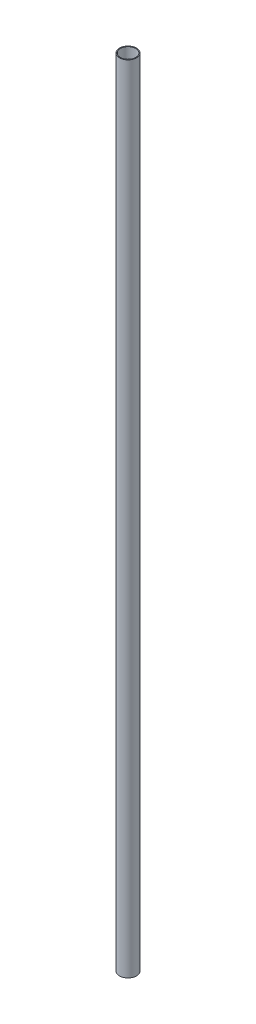
ISO-10303-21;
HEADER;
FILE_DESCRIPTION(('STEP AP214'),'2;1');
FILE_NAME('part.step','',(''),(''),'','','');
FILE_SCHEMA(('AUTOMOTIVE_DESIGN { 1 0 10303 214 1 1 1 1 }'));
ENDSEC;
DATA;
#1=APPLICATION_CONTEXT('core data for automotive mechanical design processes');
#2=APPLICATION_PROTOCOL_DEFINITION('international standard','automotive_design',2000,#1);
#3=PRODUCT_CONTEXT('',#1,'mechanical');
#4=PRODUCT('Part','Part','',(#3));
#5=PRODUCT_RELATED_PRODUCT_CATEGORY('part','',(#4));
#6=PRODUCT_DEFINITION_FORMATION('','',#4);
#7=PRODUCT_DEFINITION_CONTEXT('part definition',#1,'design');
#8=PRODUCT_DEFINITION('design','',#6,#7);
#9=PRODUCT_DEFINITION_SHAPE('','',#8);
#10=(LENGTH_UNIT() NAMED_UNIT(*) SI_UNIT(.MILLI.,.METRE.));
#11=(NAMED_UNIT(*) PLANE_ANGLE_UNIT() SI_UNIT($,.RADIAN.));
#12=(NAMED_UNIT(*) SI_UNIT($,.STERADIAN.) SOLID_ANGLE_UNIT());
#13=UNCERTAINTY_MEASURE_WITH_UNIT(LENGTH_MEASURE(1.E-05),#10,'distance_accuracy_value','');
#14=(GEOMETRIC_REPRESENTATION_CONTEXT(3) GLOBAL_UNCERTAINTY_ASSIGNED_CONTEXT((#13)) GLOBAL_UNIT_ASSIGNED_CONTEXT((#10,
#11,#12)) REPRESENTATION_CONTEXT('',''));
#15=CARTESIAN_POINT('',(0.,0.,0.));
#16=DIRECTION('',(0.,0.,1.));
#17=DIRECTION('',(1.,0.,0.));
#18=AXIS2_PLACEMENT_3D('',#15,#16,#17);
#19=CARTESIAN_POINT('',(0.,889.,0.));
#20=DIRECTION('',(0.,1.,0.));
#21=DIRECTION('',(0.,0.,1.));
#22=AXIS2_PLACEMENT_3D('',#19,#20,#21);
#23=PLANE('',#22);
#24=CARTESIAN_POINT('',(0.,889.,0.));
#25=DIRECTION('',(0.,1.,0.));
#26=DIRECTION('',(0.,0.,1.));
#27=AXIS2_PLACEMENT_3D('',#24,#25,#26);
#28=CIRCLE('',#27,9.525);
#29=CARTESIAN_POINT('',(0.,889.,9.525));
#30=VERTEX_POINT('',#29);
#31=EDGE_CURVE('E10',#30,#30,#28,.T.);
#32=ORIENTED_EDGE('',*,*,#31,.T.);
#33=EDGE_LOOP('',(#32));
#34=FACE_BOUND('',#33,.T.);
#35=CARTESIAN_POINT('',(0.,889.,0.));
#36=DIRECTION('',(0.,1.,0.));
#37=DIRECTION('',(0.,0.,1.));
#38=AXIS2_PLACEMENT_3D('',#35,#36,#37);
#39=CIRCLE('',#38,8.636);
#40=CARTESIAN_POINT('',(0.,889.,8.636));
#41=VERTEX_POINT('',#40);
#42=EDGE_CURVE('E43',#41,#41,#39,.T.);
#43=ORIENTED_EDGE('',*,*,#42,.F.);
#44=EDGE_LOOP('',(#43));
#45=FACE_BOUND('',#44,.T.);
#46=ADVANCED_FACE('F32',(#34,#45),#23,.T.);
#47=CARTESIAN_POINT('',(0.,0.,0.));
#48=DIRECTION('',(0.,1.,0.));
#49=DIRECTION('',(0.,0.,1.));
#50=AXIS2_PLACEMENT_3D('',#47,#48,#49);
#51=PLANE('',#50);
#52=CARTESIAN_POINT('',(0.,0.,0.));
#53=DIRECTION('',(0.,1.,0.));
#54=DIRECTION('',(0.,0.,1.));
#55=AXIS2_PLACEMENT_3D('',#52,#53,#54);
#56=CIRCLE('',#55,9.525);
#57=CARTESIAN_POINT('',(0.,0.,9.525));
#58=VERTEX_POINT('',#57);
#59=EDGE_CURVE('E36',#58,#58,#56,.T.);
#60=ORIENTED_EDGE('',*,*,#59,.F.);
#61=EDGE_LOOP('',(#60));
#62=FACE_BOUND('',#61,.T.);
#63=CARTESIAN_POINT('',(0.,0.,0.));
#64=DIRECTION('',(0.,1.,0.));
#65=DIRECTION('',(0.,0.,1.));
#66=AXIS2_PLACEMENT_3D('',#63,#64,#65);
#67=CIRCLE('',#66,8.636);
#68=CARTESIAN_POINT('',(0.,0.,8.636));
#69=VERTEX_POINT('',#68);
#70=EDGE_CURVE('E45',#69,#69,#67,.T.);
#71=ORIENTED_EDGE('',*,*,#70,.T.);
#72=EDGE_LOOP('',(#71));
#73=FACE_BOUND('',#72,.T.);
#74=ADVANCED_FACE('F55',(#62,#73),#51,.F.);
#75=CARTESIAN_POINT('',(0.,889.,0.));
#76=DIRECTION('',(0.,-1.,0.));
#77=DIRECTION('',(0.,0.,-1.));
#78=AXIS2_PLACEMENT_3D('',#75,#76,#77);
#79=CYLINDRICAL_SURFACE('',#78,9.525);
#80=ORIENTED_EDGE('',*,*,#31,.F.);
#81=EDGE_LOOP('',(#80));
#82=FACE_BOUND('',#81,.T.);
#83=ORIENTED_EDGE('',*,*,#59,.T.);
#84=EDGE_LOOP('',(#83));
#85=FACE_BOUND('',#84,.T.);
#86=ADVANCED_FACE('F34',(#82,#85),#79,.T.);
#87=CARTESIAN_POINT('',(0.,889.,0.));
#88=DIRECTION('',(0.,-1.,0.));
#89=DIRECTION('',(0.,0.,-1.));
#90=AXIS2_PLACEMENT_3D('',#87,#88,#89);
#91=CYLINDRICAL_SURFACE('',#90,8.636);
#92=ORIENTED_EDGE('',*,*,#42,.T.);
#93=EDGE_LOOP('',(#92));
#94=FACE_BOUND('',#93,.T.);
#95=ORIENTED_EDGE('',*,*,#70,.F.);
#96=EDGE_LOOP('',(#95));
#97=FACE_BOUND('',#96,.T.);
#98=ADVANCED_FACE('F51',(#94,#97),#91,.F.);
#99=CLOSED_SHELL('',(#46,#74,#86,#98));
#100=MANIFOLD_SOLID_BREP('B2',#99);
#101=ADVANCED_BREP_SHAPE_REPRESENTATION('',(#18,#100),#14);
#102=SHAPE_DEFINITION_REPRESENTATION(#9,#101);
ENDSEC;
END-ISO-10303-21;
